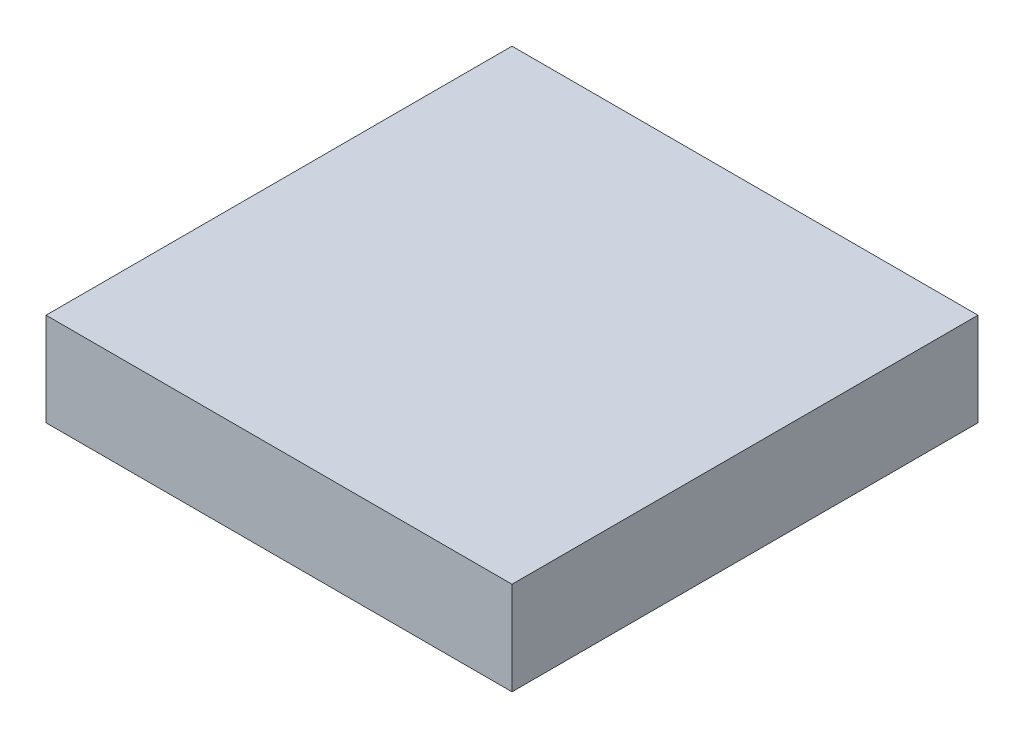
ISO-10303-21;
HEADER;
FILE_DESCRIPTION(('STEP AP214'),'2;1');
FILE_NAME('part.step','',(''),(''),'','','');
FILE_SCHEMA(('AUTOMOTIVE_DESIGN { 1 0 10303 214 1 1 1 1 }'));
ENDSEC;
DATA;
#1=APPLICATION_CONTEXT('core data for automotive mechanical design processes');
#2=APPLICATION_PROTOCOL_DEFINITION('international standard','automotive_design',2000,#1);
#3=PRODUCT_CONTEXT('',#1,'mechanical');
#4=PRODUCT('Part','Part','',(#3));
#5=PRODUCT_RELATED_PRODUCT_CATEGORY('part','',(#4));
#6=PRODUCT_DEFINITION_FORMATION('','',#4);
#7=PRODUCT_DEFINITION_CONTEXT('part definition',#1,'design');
#8=PRODUCT_DEFINITION('design','',#6,#7);
#9=PRODUCT_DEFINITION_SHAPE('','',#8);
#10=(LENGTH_UNIT() NAMED_UNIT(*) SI_UNIT(.MILLI.,.METRE.));
#11=(NAMED_UNIT(*) PLANE_ANGLE_UNIT() SI_UNIT($,.RADIAN.));
#12=(NAMED_UNIT(*) SI_UNIT($,.STERADIAN.) SOLID_ANGLE_UNIT());
#13=UNCERTAINTY_MEASURE_WITH_UNIT(LENGTH_MEASURE(1.E-05),#10,'distance_accuracy_value','');
#14=(GEOMETRIC_REPRESENTATION_CONTEXT(3) GLOBAL_UNCERTAINTY_ASSIGNED_CONTEXT((#13)) GLOBAL_UNIT_ASSIGNED_CONTEXT((#10,
#11,#12)) REPRESENTATION_CONTEXT('',''));
#15=CARTESIAN_POINT('',(0.,0.,0.));
#16=DIRECTION('',(0.,0.,1.));
#17=DIRECTION('',(1.,0.,0.));
#18=AXIS2_PLACEMENT_3D('',#15,#16,#17);
#19=CARTESIAN_POINT('',(0.,0.,0.));
#20=DIRECTION('',(0.,1.,0.));
#21=DIRECTION('',(0.,0.,1.));
#22=AXIS2_PLACEMENT_3D('',#19,#20,#21);
#23=PLANE('',#22);
#24=DIRECTION('',(0.,0.,1.));
#25=VECTOR('',#24,1.);
#26=CARTESIAN_POINT('',(0.999999999999998,0.,0.));
#27=LINE('',#26,#25);
#28=CARTESIAN_POINT('',(1.,0.,-9.));
#29=VERTEX_POINT('',#28);
#30=CARTESIAN_POINT('',(0.999999999999999,0.,-1.));
#31=VERTEX_POINT('',#30);
#32=EDGE_CURVE('E142',#29,#31,#27,.T.);
#33=ORIENTED_EDGE('',*,*,#32,.F.);
#34=DIRECTION('',(1.,0.,0.));
#35=VECTOR('',#34,1.);
#36=CARTESIAN_POINT('',(0.,0.,-9.));
#37=LINE('',#36,#35);
#38=CARTESIAN_POINT('',(9.,0.,-9.));
#39=VERTEX_POINT('',#38);
#40=EDGE_CURVE('E160',#29,#39,#37,.T.);
#41=ORIENTED_EDGE('',*,*,#40,.T.);
#42=DIRECTION('',(0.,0.,1.));
#43=VECTOR('',#42,1.);
#44=CARTESIAN_POINT('',(9.,0.,0.));
#45=LINE('',#44,#43);
#46=CARTESIAN_POINT('',(9.,0.,-0.999999999999997));
#47=VERTEX_POINT('',#46);
#48=EDGE_CURVE('E123',#39,#47,#45,.T.);
#49=ORIENTED_EDGE('',*,*,#48,.T.);
#50=DIRECTION('',(1.,0.,0.));
#51=VECTOR('',#50,1.);
#52=CARTESIAN_POINT('',(0.,0.,-1.));
#53=LINE('',#52,#51);
#54=EDGE_CURVE('E65',#31,#47,#53,.T.);
#55=ORIENTED_EDGE('',*,*,#54,.F.);
#56=EDGE_LOOP('',(#33,#41,#49,#55));
#57=FACE_BOUND('',#56,.T.);
#58=CARTESIAN_POINT('',(5.,0.,-5.));
#59=DIRECTION('',(0.,1.,0.));
#60=DIRECTION('',(0.,0.,1.));
#61=AXIS2_PLACEMENT_3D('',#58,#59,#60);
#62=CIRCLE('',#61,2.03553390593274);
#63=CARTESIAN_POINT('',(5.,0.,-2.96446609406726));
#64=VERTEX_POINT('',#63);
#65=EDGE_CURVE('E165',#64,#64,#62,.T.);
#66=ORIENTED_EDGE('',*,*,#65,.T.);
#67=EDGE_LOOP('',(#66));
#68=FACE_BOUND('',#67,.T.);
#69=ADVANCED_FACE('F50',(#57,#68),#23,.F.);
#70=CARTESIAN_POINT('',(5.,-1.,-5.));
#71=DIRECTION('',(0.,1.,0.));
#72=DIRECTION('',(0.,0.,1.));
#73=AXIS2_PLACEMENT_3D('',#70,#71,#72);
#74=CYLINDRICAL_SURFACE('',#73,2.03553390593274);
#75=CARTESIAN_POINT('',(5.,-1.,-5.));
#76=DIRECTION('',(0.,1.,0.));
#77=DIRECTION('',(0.,0.,1.));
#78=AXIS2_PLACEMENT_3D('',#75,#76,#77);
#79=CIRCLE('',#78,2.03553390593274);
#80=CARTESIAN_POINT('',(5.,-1.,-2.96446609406726));
#81=VERTEX_POINT('',#80);
#82=EDGE_CURVE('E169',#81,#81,#79,.T.);
#83=ORIENTED_EDGE('',*,*,#82,.T.);
#84=EDGE_LOOP('',(#83));
#85=FACE_BOUND('',#84,.T.);
#86=ORIENTED_EDGE('',*,*,#65,.F.);
#87=EDGE_LOOP('',(#86));
#88=FACE_BOUND('',#87,.T.);
#89=ADVANCED_FACE('F216',(#85,#88),#74,.T.);
#90=CARTESIAN_POINT('',(5.,-1.,-5.));
#91=DIRECTION('',(0.,1.,0.));
#92=DIRECTION('',(0.,0.,1.));
#93=AXIS2_PLACEMENT_3D('',#90,#91,#92);
#94=CYLINDRICAL_SURFACE('',#93,1.5);
#95=CARTESIAN_POINT('',(5.,-1.,-5.));
#96=DIRECTION('',(0.,1.,0.));
#97=DIRECTION('',(0.,0.,1.));
#98=AXIS2_PLACEMENT_3D('',#95,#96,#97);
#99=CIRCLE('',#98,1.5);
#100=CARTESIAN_POINT('',(5.,-1.,-3.5));
#101=VERTEX_POINT('',#100);
#102=EDGE_CURVE('E172',#101,#101,#99,.T.);
#103=ORIENTED_EDGE('',*,*,#102,.F.);
#104=EDGE_LOOP('',(#103));
#105=FACE_BOUND('',#104,.T.);
#106=CARTESIAN_POINT('',(5.,0.,-5.));
#107=DIRECTION('',(0.,1.,0.));
#108=DIRECTION('',(0.,0.,1.));
#109=AXIS2_PLACEMENT_3D('',#106,#107,#108);
#110=CIRCLE('',#109,1.5);
#111=CARTESIAN_POINT('',(5.,0.,-3.5));
#112=VERTEX_POINT('',#111);
#113=EDGE_CURVE('E12',#112,#112,#110,.T.);
#114=ORIENTED_EDGE('',*,*,#113,.T.);
#115=EDGE_LOOP('',(#114));
#116=FACE_BOUND('',#115,.T.);
#117=ADVANCED_FACE('F222',(#105,#116),#94,.F.);
#118=CARTESIAN_POINT('',(0.,-1.,0.));
#119=DIRECTION('',(0.,1.,0.));
#120=DIRECTION('',(0.,0.,1.));
#121=AXIS2_PLACEMENT_3D('',#118,#119,#120);
#122=PLANE('',#121);
#123=ORIENTED_EDGE('',*,*,#82,.F.);
#124=EDGE_LOOP('',(#123));
#125=FACE_BOUND('',#124,.T.);
#126=ORIENTED_EDGE('',*,*,#102,.T.);
#127=EDGE_LOOP('',(#126));
#128=FACE_BOUND('',#127,.T.);
#129=ADVANCED_FACE('F228',(#125,#128),#122,.F.);
#130=ORIENTED_EDGE('',*,*,#113,.F.);
#131=EDGE_LOOP('',(#130));
#132=FACE_BOUND('',#131,.T.);
#133=ADVANCED_FACE('F218',(#132),#23,.F.);
#134=CARTESIAN_POINT('',(0.,-1.,-9.));
#135=DIRECTION('',(0.,0.,1.));
#136=DIRECTION('',(1.,0.,0.));
#137=AXIS2_PLACEMENT_3D('',#134,#135,#136);
#138=PLANE('',#137);
#139=ORIENTED_EDGE('',*,*,#40,.F.);
#140=DIRECTION('',(0.,1.,0.));
#141=VECTOR('',#140,1.);
#142=CARTESIAN_POINT('',(1.,-1.,-9.));
#143=LINE('',#142,#141);
#144=CARTESIAN_POINT('',(1.,-1.,-9.));
#145=VERTEX_POINT('',#144);
#146=EDGE_CURVE('E140',#145,#29,#143,.T.);
#147=ORIENTED_EDGE('',*,*,#146,.F.);
#148=DIRECTION('',(1.,0.,0.));
#149=VECTOR('',#148,1.);
#150=CARTESIAN_POINT('',(0.,-1.,-9.));
#151=LINE('',#150,#149);
#152=CARTESIAN_POINT('',(9.,-1.,-9.));
#153=VERTEX_POINT('',#152);
#154=EDGE_CURVE('E135',#145,#153,#151,.T.);
#155=ORIENTED_EDGE('',*,*,#154,.T.);
#156=DIRECTION('',(0.,1.,0.));
#157=VECTOR('',#156,1.);
#158=CARTESIAN_POINT('',(9.,-1.,-9.));
#159=LINE('',#158,#157);
#160=EDGE_CURVE('E118',#153,#39,#159,.T.);
#161=ORIENTED_EDGE('',*,*,#160,.T.);
#162=EDGE_LOOP('',(#139,#147,#155,#161));
#163=FACE_BOUND('',#162,.T.);
#164=ADVANCED_FACE('F139',(#163),#138,.T.);
#165=CARTESIAN_POINT('',(0.999999999999998,-1.,0.));
#166=DIRECTION('',(-1.,0.,0.));
#167=DIRECTION('',(0.,0.,1.));
#168=AXIS2_PLACEMENT_3D('',#165,#166,#167);
#169=PLANE('',#168);
#170=ORIENTED_EDGE('',*,*,#32,.T.);
#171=DIRECTION('',(0.,1.,0.));
#172=VECTOR('',#171,1.);
#173=CARTESIAN_POINT('',(0.999999999999999,-1.,-1.));
#174=LINE('',#173,#172);
#175=CARTESIAN_POINT('',(0.999999999999999,-1.,-1.));
#176=VERTEX_POINT('',#175);
#177=EDGE_CURVE('E166',#176,#31,#174,.T.);
#178=ORIENTED_EDGE('',*,*,#177,.F.);
#179=DIRECTION('',(0.,0.,1.));
#180=VECTOR('',#179,1.);
#181=CARTESIAN_POINT('',(0.999999999999998,-1.,0.));
#182=LINE('',#181,#180);
#183=EDGE_CURVE('E147',#145,#176,#182,.T.);
#184=ORIENTED_EDGE('',*,*,#183,.F.);
#185=ORIENTED_EDGE('',*,*,#146,.T.);
#186=EDGE_LOOP('',(#170,#178,#184,#185));
#187=FACE_BOUND('',#186,.T.);
#188=ADVANCED_FACE('F234',(#187),#169,.F.);
#189=CARTESIAN_POINT('',(0.,-1.,-1.));
#190=DIRECTION('',(0.,0.,1.));
#191=DIRECTION('',(1.,0.,0.));
#192=AXIS2_PLACEMENT_3D('',#189,#190,#191);
#193=PLANE('',#192);
#194=ORIENTED_EDGE('',*,*,#54,.T.);
#195=DIRECTION('',(0.,1.,0.));
#196=VECTOR('',#195,1.);
#197=CARTESIAN_POINT('',(9.,-1.,-0.999999999999997));
#198=LINE('',#197,#196);
#199=CARTESIAN_POINT('',(9.,-1.,-0.999999999999997));
#200=VERTEX_POINT('',#199);
#201=EDGE_CURVE('E128',#200,#47,#198,.T.);
#202=ORIENTED_EDGE('',*,*,#201,.F.);
#203=DIRECTION('',(1.,0.,0.));
#204=VECTOR('',#203,1.);
#205=CARTESIAN_POINT('',(0.,-1.,-1.));
#206=LINE('',#205,#204);
#207=EDGE_CURVE('E137',#176,#200,#206,.T.);
#208=ORIENTED_EDGE('',*,*,#207,.F.);
#209=ORIENTED_EDGE('',*,*,#177,.T.);
#210=EDGE_LOOP('',(#194,#202,#208,#209));
#211=FACE_BOUND('',#210,.T.);
#212=ADVANCED_FACE('F249',(#211),#193,.F.);
#213=CARTESIAN_POINT('',(9.,-1.,0.));
#214=DIRECTION('',(-1.,0.,0.));
#215=DIRECTION('',(0.,0.,1.));
#216=AXIS2_PLACEMENT_3D('',#213,#214,#215);
#217=PLANE('',#216);
#218=ORIENTED_EDGE('',*,*,#48,.F.);
#219=ORIENTED_EDGE('',*,*,#160,.F.);
#220=DIRECTION('',(0.,0.,1.));
#221=VECTOR('',#220,1.);
#222=CARTESIAN_POINT('',(9.,-1.,0.));
#223=LINE('',#222,#221);
#224=EDGE_CURVE('E121',#153,#200,#223,.T.);
#225=ORIENTED_EDGE('',*,*,#224,.T.);
#226=ORIENTED_EDGE('',*,*,#201,.T.);
#227=EDGE_LOOP('',(#218,#219,#225,#226));
#228=FACE_BOUND('',#227,.T.);
#229=ADVANCED_FACE('F120',(#228),#217,.T.);
#230=CARTESIAN_POINT('',(0.,-1.,0.));
#231=DIRECTION('',(0.,1.,0.));
#232=DIRECTION('',(0.,0.,1.));
#233=AXIS2_PLACEMENT_3D('',#230,#231,#232);
#234=PLANE('',#233);
#235=ORIENTED_EDGE('',*,*,#154,.F.);
#236=ORIENTED_EDGE('',*,*,#183,.T.);
#237=ORIENTED_EDGE('',*,*,#207,.T.);
#238=ORIENTED_EDGE('',*,*,#224,.F.);
#239=EDGE_LOOP('',(#235,#236,#237,#238));
#240=FACE_BOUND('',#239,.T.);
#241=DIRECTION('',(0.,0.,-1.));
#242=VECTOR('',#241,1.);
#243=CARTESIAN_POINT('',(10.,-1.,0.));
#244=LINE('',#243,#242);
#245=CARTESIAN_POINT('',(10.,-1.,0.));
#246=VERTEX_POINT('',#245);
#247=CARTESIAN_POINT('',(10.,-1.,-10.));
#248=VERTEX_POINT('',#247);
#249=EDGE_CURVE('E149',#246,#248,#244,.T.);
#250=ORIENTED_EDGE('',*,*,#249,.F.);
#251=DIRECTION('',(1.,0.,0.));
#252=VECTOR('',#251,1.);
#253=CARTESIAN_POINT('',(0.,-1.,0.));
#254=LINE('',#253,#252);
#255=CARTESIAN_POINT('',(0.,-1.,0.));
#256=VERTEX_POINT('',#255);
#257=EDGE_CURVE('E129',#256,#246,#254,.T.);
#258=ORIENTED_EDGE('',*,*,#257,.F.);
#259=DIRECTION('',(0.,0.,-1.));
#260=VECTOR('',#259,1.);
#261=CARTESIAN_POINT('',(0.,-1.,0.));
#262=LINE('',#261,#260);
#263=CARTESIAN_POINT('',(0.,-1.,-10.));
#264=VERTEX_POINT('',#263);
#265=EDGE_CURVE('E155',#256,#264,#262,.T.);
#266=ORIENTED_EDGE('',*,*,#265,.T.);
#267=DIRECTION('',(1.,0.,0.));
#268=VECTOR('',#267,1.);
#269=CARTESIAN_POINT('',(0.,-1.,-10.));
#270=LINE('',#269,#268);
#271=EDGE_CURVE('E152',#264,#248,#270,.T.);
#272=ORIENTED_EDGE('',*,*,#271,.T.);
#273=EDGE_LOOP('',(#250,#258,#266,#272));
#274=FACE_BOUND('',#273,.T.);
#275=ADVANCED_FACE('F133',(#240,#274),#234,.F.);
#276=CARTESIAN_POINT('',(0.,1.,0.));
#277=DIRECTION('',(0.,1.,0.));
#278=DIRECTION('',(0.,0.,1.));
#279=AXIS2_PLACEMENT_3D('',#276,#277,#278);
#280=PLANE('',#279);
#281=DIRECTION('',(0.,0.,-1.));
#282=VECTOR('',#281,1.);
#283=CARTESIAN_POINT('',(10.,1.,0.));
#284=LINE('',#283,#282);
#285=CARTESIAN_POINT('',(10.,1.,0.));
#286=VERTEX_POINT('',#285);
#287=CARTESIAN_POINT('',(10.,1.,-10.));
#288=VERTEX_POINT('',#287);
#289=EDGE_CURVE('E175',#286,#288,#284,.T.);
#290=ORIENTED_EDGE('',*,*,#289,.T.);
#291=DIRECTION('',(1.,0.,0.));
#292=VECTOR('',#291,1.);
#293=CARTESIAN_POINT('',(0.,1.,-10.));
#294=LINE('',#293,#292);
#295=CARTESIAN_POINT('',(0.,1.,-10.));
#296=VERTEX_POINT('',#295);
#297=EDGE_CURVE('E179',#296,#288,#294,.T.);
#298=ORIENTED_EDGE('',*,*,#297,.F.);
#299=DIRECTION('',(0.,0.,-1.));
#300=VECTOR('',#299,1.);
#301=CARTESIAN_POINT('',(0.,1.,0.));
#302=LINE('',#301,#300);
#303=CARTESIAN_POINT('',(0.,1.,0.));
#304=VERTEX_POINT('',#303);
#305=EDGE_CURVE('E182',#304,#296,#302,.T.);
#306=ORIENTED_EDGE('',*,*,#305,.F.);
#307=DIRECTION('',(1.,0.,0.));
#308=VECTOR('',#307,1.);
#309=CARTESIAN_POINT('',(0.,1.,0.));
#310=LINE('',#309,#308);
#311=EDGE_CURVE('E73',#304,#286,#310,.T.);
#312=ORIENTED_EDGE('',*,*,#311,.T.);
#313=EDGE_LOOP('',(#290,#298,#306,#312));
#314=FACE_BOUND('',#313,.T.);
#315=ADVANCED_FACE('F205',(#314),#280,.T.);
#316=CARTESIAN_POINT('',(0.,1.,-10.));
#317=DIRECTION('',(0.,0.,-1.));
#318=DIRECTION('',(-1.,0.,0.));
#319=AXIS2_PLACEMENT_3D('',#316,#317,#318);
#320=PLANE('',#319);
#321=DIRECTION('',(0.,-1.,0.));
#322=VECTOR('',#321,1.);
#323=CARTESIAN_POINT('',(10.,1.,-10.));
#324=LINE('',#323,#322);
#325=EDGE_CURVE('E58',#288,#248,#324,.T.);
#326=ORIENTED_EDGE('',*,*,#325,.T.);
#327=ORIENTED_EDGE('',*,*,#271,.F.);
#328=DIRECTION('',(0.,-1.,0.));
#329=VECTOR('',#328,1.);
#330=CARTESIAN_POINT('',(0.,1.,-10.));
#331=LINE('',#330,#329);
#332=EDGE_CURVE('E190',#296,#264,#331,.T.);
#333=ORIENTED_EDGE('',*,*,#332,.F.);
#334=ORIENTED_EDGE('',*,*,#297,.T.);
#335=EDGE_LOOP('',(#326,#327,#333,#334));
#336=FACE_BOUND('',#335,.T.);
#337=ADVANCED_FACE('F194',(#336),#320,.T.);
#338=CARTESIAN_POINT('',(0.,1.,0.));
#339=DIRECTION('',(-1.,0.,0.));
#340=DIRECTION('',(0.,0.,1.));
#341=AXIS2_PLACEMENT_3D('',#338,#339,#340);
#342=PLANE('',#341);
#343=ORIENTED_EDGE('',*,*,#332,.T.);
#344=ORIENTED_EDGE('',*,*,#265,.F.);
#345=DIRECTION('',(0.,-1.,0.));
#346=VECTOR('',#345,1.);
#347=CARTESIAN_POINT('',(0.,1.,0.));
#348=LINE('',#347,#346);
#349=EDGE_CURVE('E188',#304,#256,#348,.T.);
#350=ORIENTED_EDGE('',*,*,#349,.F.);
#351=ORIENTED_EDGE('',*,*,#305,.T.);
#352=EDGE_LOOP('',(#343,#344,#350,#351));
#353=FACE_BOUND('',#352,.T.);
#354=ADVANCED_FACE('F204',(#353),#342,.T.);
#355=CARTESIAN_POINT('',(0.,1.,0.));
#356=DIRECTION('',(0.,0.,-1.));
#357=DIRECTION('',(-1.,0.,0.));
#358=AXIS2_PLACEMENT_3D('',#355,#356,#357);
#359=PLANE('',#358);
#360=ORIENTED_EDGE('',*,*,#349,.T.);
#361=ORIENTED_EDGE('',*,*,#257,.T.);
#362=DIRECTION('',(0.,-1.,0.));
#363=VECTOR('',#362,1.);
#364=CARTESIAN_POINT('',(10.,1.,0.));
#365=LINE('',#364,#363);
#366=EDGE_CURVE('E186',#286,#246,#365,.T.);
#367=ORIENTED_EDGE('',*,*,#366,.F.);
#368=ORIENTED_EDGE('',*,*,#311,.F.);
#369=EDGE_LOOP('',(#360,#361,#367,#368));
#370=FACE_BOUND('',#369,.T.);
#371=ADVANCED_FACE('F202',(#370),#359,.F.);
#372=CARTESIAN_POINT('',(10.,1.,0.));
#373=DIRECTION('',(-1.,0.,0.));
#374=DIRECTION('',(0.,0.,1.));
#375=AXIS2_PLACEMENT_3D('',#372,#373,#374);
#376=PLANE('',#375);
#377=ORIENTED_EDGE('',*,*,#366,.T.);
#378=ORIENTED_EDGE('',*,*,#249,.T.);
#379=ORIENTED_EDGE('',*,*,#325,.F.);
#380=ORIENTED_EDGE('',*,*,#289,.F.);
#381=EDGE_LOOP('',(#377,#378,#379,#380));
#382=FACE_BOUND('',#381,.T.);
#383=ADVANCED_FACE('F52',(#382),#376,.F.);
#384=CLOSED_SHELL('',(#69,#89,#117,#129,#133,#164,#188,#212,#229,#275,#315,#337,#354,#371,#383));
#385=MANIFOLD_SOLID_BREP('B2',#384);
#386=ADVANCED_BREP_SHAPE_REPRESENTATION('',(#18,#385),#14);
#387=SHAPE_DEFINITION_REPRESENTATION(#9,#386);
ENDSEC;
END-ISO-10303-21;
